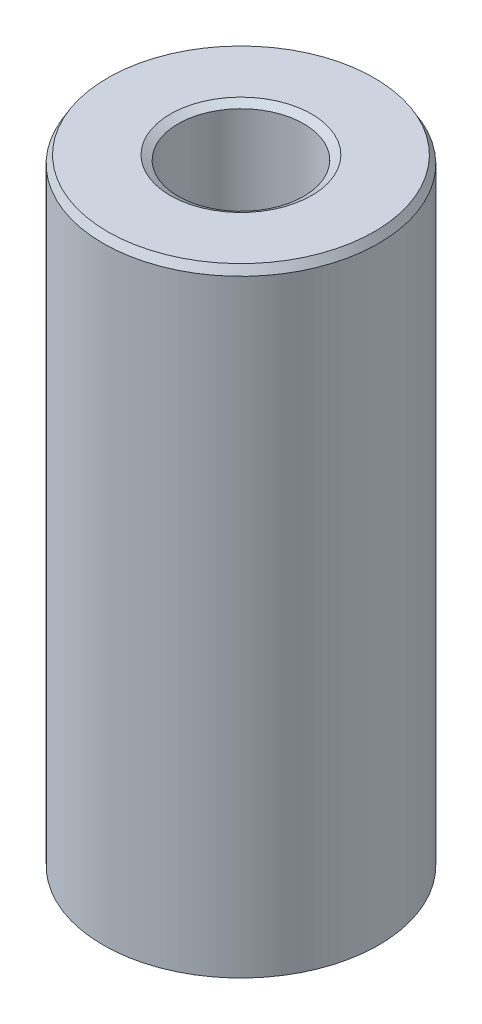
ISO-10303-21;
HEADER;
FILE_DESCRIPTION(('STEP AP214'),'2;1');
FILE_NAME('part.step','',(''),(''),'','','');
FILE_SCHEMA(('AUTOMOTIVE_DESIGN { 1 0 10303 214 1 1 1 1 }'));
ENDSEC;
DATA;
#1=APPLICATION_CONTEXT('core data for automotive mechanical design processes');
#2=APPLICATION_PROTOCOL_DEFINITION('international standard','automotive_design',2000,#1);
#3=PRODUCT_CONTEXT('',#1,'mechanical');
#4=PRODUCT('Part','Part','',(#3));
#5=PRODUCT_RELATED_PRODUCT_CATEGORY('part','',(#4));
#6=PRODUCT_DEFINITION_FORMATION('','',#4);
#7=PRODUCT_DEFINITION_CONTEXT('part definition',#1,'design');
#8=PRODUCT_DEFINITION('design','',#6,#7);
#9=PRODUCT_DEFINITION_SHAPE('','',#8);
#10=(LENGTH_UNIT() NAMED_UNIT(*) SI_UNIT(.MILLI.,.METRE.));
#11=(NAMED_UNIT(*) PLANE_ANGLE_UNIT() SI_UNIT($,.RADIAN.));
#12=(NAMED_UNIT(*) SI_UNIT($,.STERADIAN.) SOLID_ANGLE_UNIT());
#13=UNCERTAINTY_MEASURE_WITH_UNIT(LENGTH_MEASURE(1.E-05),#10,'distance_accuracy_value','');
#14=(GEOMETRIC_REPRESENTATION_CONTEXT(3) GLOBAL_UNCERTAINTY_ASSIGNED_CONTEXT((#13)) GLOBAL_UNIT_ASSIGNED_CONTEXT((#10,
#11,#12)) REPRESENTATION_CONTEXT('',''));
#15=CARTESIAN_POINT('',(0.,0.,0.));
#16=DIRECTION('',(0.,0.,1.));
#17=DIRECTION('',(1.,0.,0.));
#18=AXIS2_PLACEMENT_3D('',#15,#16,#17);
#19=CARTESIAN_POINT('',(0.,270.008830241666,0.));
#20=DIRECTION('',(0.,-1.,0.));
#21=DIRECTION('',(0.,0.,-1.));
#22=AXIS2_PLACEMENT_3D('',#19,#20,#21);
#23=CYLINDRICAL_SURFACE('',#22,60.);
#24=CARTESIAN_POINT('',(0.,1.96942865353478,0.));
#25=DIRECTION('',(0.,1.,0.));
#26=DIRECTION('',(0.,0.,1.));
#27=AXIS2_PLACEMENT_3D('',#24,#25,#26);
#28=CIRCLE('',#27,60.);
#29=CARTESIAN_POINT('',(0.,1.96942865353478,60.));
#30=VERTEX_POINT('',#29);
#31=EDGE_CURVE('E10',#30,#30,#28,.T.);
#32=ORIENTED_EDGE('',*,*,#31,.T.);
#33=EDGE_LOOP('',(#32));
#34=FACE_BOUND('',#33,.T.);
#35=CARTESIAN_POINT('',(0.,266.597679751861,0.));
#36=DIRECTION('',(0.,1.,0.));
#37=DIRECTION('',(0.,0.,1.));
#38=AXIS2_PLACEMENT_3D('',#35,#36,#37);
#39=CIRCLE('',#38,60.);
#40=CARTESIAN_POINT('',(0.,266.597679751861,60.));
#41=VERTEX_POINT('',#40);
#42=EDGE_CURVE('E50',#41,#41,#39,.F.);
#43=ORIENTED_EDGE('',*,*,#42,.T.);
#44=EDGE_LOOP('',(#43));
#45=FACE_BOUND('',#44,.T.);
#46=ADVANCED_FACE('F39',(#34,#45),#23,.T.);
#47=CARTESIAN_POINT('',(0.,270.008830241666,0.));
#48=DIRECTION('',(0.,1.,0.));
#49=DIRECTION('',(0.,0.,1.));
#50=AXIS2_PLACEMENT_3D('',#47,#48,#49);
#51=PLANE('',#50);
#52=CARTESIAN_POINT('',(0.,270.008830241666,0.));
#53=DIRECTION('',(0.,1.,0.));
#54=DIRECTION('',(0.,0.,1.));
#55=AXIS2_PLACEMENT_3D('',#52,#53,#54);
#56=CIRCLE('',#55,30.7744315367564);
#57=CARTESIAN_POINT('',(0.,270.008830241666,30.7744315367564));
#58=VERTEX_POINT('',#57);
#59=EDGE_CURVE('E58',#58,#58,#56,.F.);
#60=ORIENTED_EDGE('',*,*,#59,.T.);
#61=EDGE_LOOP('',(#60));
#62=FACE_BOUND('',#61,.T.);
#63=CARTESIAN_POINT('',(0.,270.008830241666,0.));
#64=DIRECTION('',(0.,1.,0.));
#65=DIRECTION('',(0.,0.,1.));
#66=AXIS2_PLACEMENT_3D('',#63,#64,#65);
#67=CIRCLE('',#66,58.0305713464652);
#68=CARTESIAN_POINT('',(0.,270.008830241666,58.0305713464652));
#69=VERTEX_POINT('',#68);
#70=EDGE_CURVE('E61',#69,#69,#67,.T.);
#71=ORIENTED_EDGE('',*,*,#70,.T.);
#72=EDGE_LOOP('',(#71));
#73=FACE_BOUND('',#72,.T.);
#74=ADVANCED_FACE('F88',(#62,#73),#51,.T.);
#75=CARTESIAN_POINT('',(0.,0.,0.));
#76=DIRECTION('',(0.,1.,0.));
#77=DIRECTION('',(0.,0.,1.));
#78=AXIS2_PLACEMENT_3D('',#75,#76,#77);
#79=PLANE('',#78);
#80=CARTESIAN_POINT('',(0.,0.,0.));
#81=DIRECTION('',(0.,1.,0.));
#82=DIRECTION('',(0.,0.,1.));
#83=AXIS2_PLACEMENT_3D('',#80,#81,#82);
#84=CIRCLE('',#83,29.332709700487);
#85=CARTESIAN_POINT('',(0.,0.,29.332709700487));
#86=VERTEX_POINT('',#85);
#87=EDGE_CURVE('E51',#86,#86,#84,.T.);
#88=ORIENTED_EDGE('',*,*,#87,.T.);
#89=EDGE_LOOP('',(#88));
#90=FACE_BOUND('',#89,.T.);
#91=CARTESIAN_POINT('',(0.,0.,0.));
#92=DIRECTION('',(0.,1.,0.));
#93=DIRECTION('',(0.,0.,1.));
#94=AXIS2_PLACEMENT_3D('',#91,#92,#93);
#95=CIRCLE('',#94,56.5888495101958);
#96=CARTESIAN_POINT('',(0.,0.,56.5888495101958));
#97=VERTEX_POINT('',#96);
#98=EDGE_CURVE('E54',#97,#97,#95,.F.);
#99=ORIENTED_EDGE('',*,*,#98,.T.);
#100=EDGE_LOOP('',(#99));
#101=FACE_BOUND('',#100,.T.);
#102=ADVANCED_FACE('F83',(#90,#101),#79,.F.);
#103=CARTESIAN_POINT('',(0.,270.008830241666,0.));
#104=DIRECTION('',(0.,-1.,0.));
#105=DIRECTION('',(0.,0.,-1.));
#106=AXIS2_PLACEMENT_3D('',#103,#104,#105);
#107=CYLINDRICAL_SURFACE('',#106,27.3632810469522);
#108=CARTESIAN_POINT('',(0.,268.039401588131,0.));
#109=DIRECTION('',(0.,1.,0.));
#110=DIRECTION('',(0.,0.,1.));
#111=AXIS2_PLACEMENT_3D('',#108,#109,#110);
#112=CIRCLE('',#111,27.3632810469522);
#113=CARTESIAN_POINT('',(0.,268.039401588131,27.3632810469522));
#114=VERTEX_POINT('',#113);
#115=EDGE_CURVE('E67',#114,#114,#112,.T.);
#116=ORIENTED_EDGE('',*,*,#115,.T.);
#117=EDGE_LOOP('',(#116));
#118=FACE_BOUND('',#117,.T.);
#119=CARTESIAN_POINT('',(0.,3.41115048980423,0.));
#120=DIRECTION('',(0.,1.,0.));
#121=DIRECTION('',(0.,0.,1.));
#122=AXIS2_PLACEMENT_3D('',#119,#120,#121);
#123=CIRCLE('',#122,27.3632810469522);
#124=CARTESIAN_POINT('',(0.,3.41115048980423,27.3632810469522));
#125=VERTEX_POINT('',#124);
#126=EDGE_CURVE('E69',#125,#125,#123,.F.);
#127=ORIENTED_EDGE('',*,*,#126,.T.);
#128=EDGE_LOOP('',(#127));
#129=FACE_BOUND('',#128,.T.);
#130=ADVANCED_FACE('F71',(#118,#129),#107,.F.);
#131=CARTESIAN_POINT('',(0.,268.039401588131,0.));
#132=DIRECTION('',(0.,1.,0.));
#133=DIRECTION('',(0.,0.,1.));
#134=AXIS2_PLACEMENT_3D('',#131,#132,#133);
#135=CONICAL_SURFACE('',#134,27.3632810469522,1.0471975511966);
#136=ORIENTED_EDGE('',*,*,#59,.F.);
#137=EDGE_LOOP('',(#136));
#138=FACE_BOUND('',#137,.T.);
#139=ORIENTED_EDGE('',*,*,#115,.F.);
#140=EDGE_LOOP('',(#139));
#141=FACE_BOUND('',#140,.T.);
#142=ADVANCED_FACE('F77',(#138,#141),#135,.F.);
#143=CARTESIAN_POINT('',(0.,0.,0.));
#144=DIRECTION('',(0.,-1.,0.));
#145=DIRECTION('',(0.,0.,-1.));
#146=AXIS2_PLACEMENT_3D('',#143,#144,#145);
#147=CONICAL_SURFACE('',#146,29.332709700487,0.523598775598295);
#148=ORIENTED_EDGE('',*,*,#126,.F.);
#149=EDGE_LOOP('',(#148));
#150=FACE_BOUND('',#149,.T.);
#151=ORIENTED_EDGE('',*,*,#87,.F.);
#152=EDGE_LOOP('',(#151));
#153=FACE_BOUND('',#152,.T.);
#154=ADVANCED_FACE('F73',(#150,#153),#147,.F.);
#155=CARTESIAN_POINT('',(0.,1.96942865353478,0.));
#156=DIRECTION('',(0.,1.,0.));
#157=DIRECTION('',(0.,0.,1.));
#158=AXIS2_PLACEMENT_3D('',#155,#156,#157);
#159=CONICAL_SURFACE('',#158,60.,1.0471975511966);
#160=ORIENTED_EDGE('',*,*,#98,.F.);
#161=EDGE_LOOP('',(#160));
#162=FACE_BOUND('',#161,.T.);
#163=ORIENTED_EDGE('',*,*,#31,.F.);
#164=EDGE_LOOP('',(#163));
#165=FACE_BOUND('',#164,.T.);
#166=ADVANCED_FACE('F76',(#162,#165),#159,.T.);
#167=CARTESIAN_POINT('',(0.,270.008830241666,0.));
#168=DIRECTION('',(0.,-1.,0.));
#169=DIRECTION('',(0.,0.,-1.));
#170=AXIS2_PLACEMENT_3D('',#167,#168,#169);
#171=CONICAL_SURFACE('',#170,58.0305713464652,0.523598775598301);
#172=ORIENTED_EDGE('',*,*,#42,.F.);
#173=EDGE_LOOP('',(#172));
#174=FACE_BOUND('',#173,.T.);
#175=ORIENTED_EDGE('',*,*,#70,.F.);
#176=EDGE_LOOP('',(#175));
#177=FACE_BOUND('',#176,.T.);
#178=ADVANCED_FACE('F45',(#174,#177),#171,.T.);
#179=CLOSED_SHELL('',(#46,#74,#102,#130,#142,#154,#166,#178));
#180=MANIFOLD_SOLID_BREP('B2',#179);
#181=ADVANCED_BREP_SHAPE_REPRESENTATION('',(#18,#180),#14);
#182=SHAPE_DEFINITION_REPRESENTATION(#9,#181);
ENDSEC;
END-ISO-10303-21;
